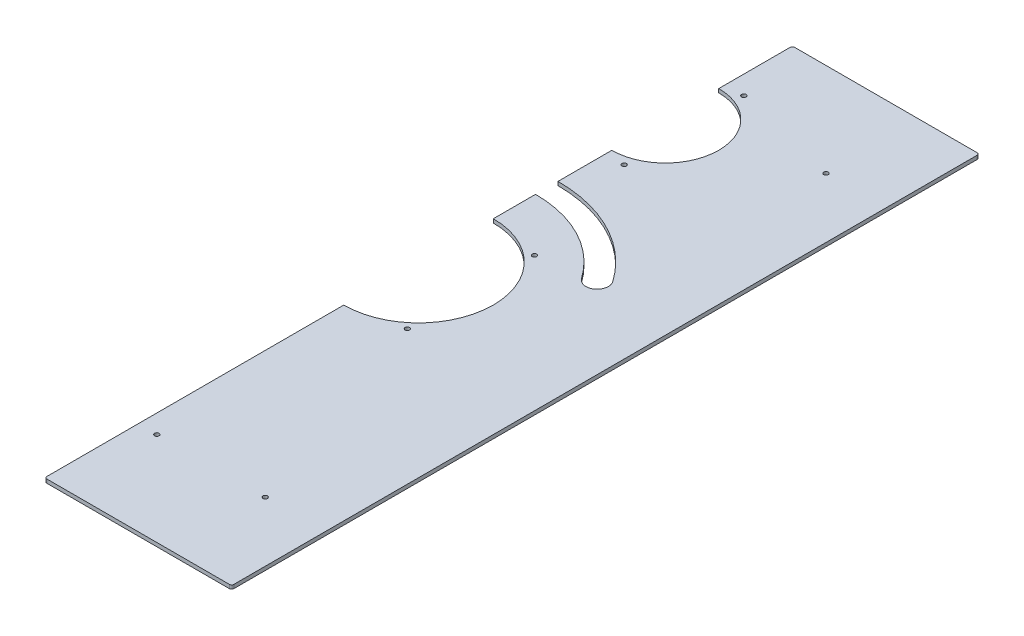
ISO-10303-21;
HEADER;
FILE_DESCRIPTION(('STEP AP214'),'2;1');
FILE_NAME('part.step','',(''),(''),'','','');
FILE_SCHEMA(('AUTOMOTIVE_DESIGN { 1 0 10303 214 1 1 1 1 }'));
ENDSEC;
DATA;
#1=APPLICATION_CONTEXT('core data for automotive mechanical design processes');
#2=APPLICATION_PROTOCOL_DEFINITION('international standard','automotive_design',2000,#1);
#3=PRODUCT_CONTEXT('',#1,'mechanical');
#4=PRODUCT('Part','Part','',(#3));
#5=PRODUCT_RELATED_PRODUCT_CATEGORY('part','',(#4));
#6=PRODUCT_DEFINITION_FORMATION('','',#4);
#7=PRODUCT_DEFINITION_CONTEXT('part definition',#1,'design');
#8=PRODUCT_DEFINITION('design','',#6,#7);
#9=PRODUCT_DEFINITION_SHAPE('','',#8);
#10=(LENGTH_UNIT() NAMED_UNIT(*) SI_UNIT(.MILLI.,.METRE.));
#11=(NAMED_UNIT(*) PLANE_ANGLE_UNIT() SI_UNIT($,.RADIAN.));
#12=(NAMED_UNIT(*) SI_UNIT($,.STERADIAN.) SOLID_ANGLE_UNIT());
#13=UNCERTAINTY_MEASURE_WITH_UNIT(LENGTH_MEASURE(1.E-05),#10,'distance_accuracy_value','');
#14=(GEOMETRIC_REPRESENTATION_CONTEXT(3) GLOBAL_UNCERTAINTY_ASSIGNED_CONTEXT((#13)) GLOBAL_UNIT_ASSIGNED_CONTEXT((#10,
#11,#12)) REPRESENTATION_CONTEXT('',''));
#15=CARTESIAN_POINT('',(0.,0.,0.));
#16=DIRECTION('',(0.,0.,1.));
#17=DIRECTION('',(1.,0.,0.));
#18=AXIS2_PLACEMENT_3D('',#15,#16,#17);
#19=CARTESIAN_POINT('',(125.,5.,500.));
#20=DIRECTION('',(1.,0.,0.));
#21=DIRECTION('',(0.,0.,1.));
#22=AXIS2_PLACEMENT_3D('',#19,#20,#21);
#23=PLANE('',#22);
#24=DIRECTION('',(0.,0.,-1.));
#25=VECTOR('',#24,1.);
#26=CARTESIAN_POINT('',(125.,0.,500.));
#27=LINE('',#26,#25);
#28=CARTESIAN_POINT('',(125.,0.,-99.9999999999999));
#29=VERTEX_POINT('',#28);
#30=CARTESIAN_POINT('',(125.,0.,-156.5));
#31=VERTEX_POINT('',#30);
#32=EDGE_CURVE('E168',#29,#31,#27,.T.);
#33=ORIENTED_EDGE('',*,*,#32,.F.);
#34=DIRECTION('',(0.,1.,0.));
#35=VECTOR('',#34,1.);
#36=CARTESIAN_POINT('',(125.,-0.00100000000000013,-99.9999999999999));
#37=LINE('',#36,#35);
#38=CARTESIAN_POINT('',(125.,5.,-99.9999999999999));
#39=VERTEX_POINT('',#38);
#40=EDGE_CURVE('E275',#29,#39,#37,.T.);
#41=ORIENTED_EDGE('',*,*,#40,.T.);
#42=DIRECTION('',(0.,0.,-1.));
#43=VECTOR('',#42,1.);
#44=CARTESIAN_POINT('',(125.,5.,500.));
#45=LINE('',#44,#43);
#46=CARTESIAN_POINT('',(125.,5.,-156.5));
#47=VERTEX_POINT('',#46);
#48=EDGE_CURVE('E170',#39,#47,#45,.T.);
#49=ORIENTED_EDGE('',*,*,#48,.T.);
#50=DIRECTION('',(0.,1.,0.));
#51=VECTOR('',#50,1.);
#52=CARTESIAN_POINT('',(125.,-0.00100000000000013,-156.5));
#53=LINE('',#52,#51);
#54=EDGE_CURVE('E156',#47,#31,#53,.F.);
#55=ORIENTED_EDGE('',*,*,#54,.T.);
#56=EDGE_LOOP('',(#33,#41,#49,#55));
#57=FACE_BOUND('',#56,.T.);
#58=ADVANCED_FACE('F37',(#57),#23,.F.);
#59=CARTESIAN_POINT('',(125.,0.,497.));
#60=VERTEX_POINT('',#59);
#61=CARTESIAN_POINT('',(125.,0.,100.));
#62=VERTEX_POINT('',#61);
#63=EDGE_CURVE('E178',#60,#62,#27,.T.);
#64=ORIENTED_EDGE('',*,*,#63,.F.);
#65=DIRECTION('',(0.,-1.,0.));
#66=VECTOR('',#65,1.);
#67=CARTESIAN_POINT('',(125.,5.,497.));
#68=LINE('',#67,#66);
#69=CARTESIAN_POINT('',(125.,5.,497.));
#70=VERTEX_POINT('',#69);
#71=EDGE_CURVE('E45',#70,#60,#68,.T.);
#72=ORIENTED_EDGE('',*,*,#71,.F.);
#73=CARTESIAN_POINT('',(125.,5.,100.));
#74=VERTEX_POINT('',#73);
#75=EDGE_CURVE('E256',#70,#74,#45,.T.);
#76=ORIENTED_EDGE('',*,*,#75,.T.);
#77=DIRECTION('',(0.,1.,0.));
#78=VECTOR('',#77,1.);
#79=CARTESIAN_POINT('',(125.,-0.00100000000000013,100.));
#80=LINE('',#79,#78);
#81=EDGE_CURVE('E239',#74,#62,#80,.F.);
#82=ORIENTED_EDGE('',*,*,#81,.T.);
#83=EDGE_LOOP('',(#64,#72,#76,#82));
#84=FACE_BOUND('',#83,.T.);
#85=ADVANCED_FACE('F237',(#84),#23,.F.);
#86=CARTESIAN_POINT('',(125.,5.,-186.5));
#87=VERTEX_POINT('',#86);
#88=CARTESIAN_POINT('',(125.,5.,-258.5));
#89=VERTEX_POINT('',#88);
#90=EDGE_CURVE('E372',#87,#89,#45,.T.);
#91=ORIENTED_EDGE('',*,*,#90,.T.);
#92=DIRECTION('',(0.,1.,0.));
#93=VECTOR('',#92,1.);
#94=CARTESIAN_POINT('',(125.,-0.00100000000000013,-258.5));
#95=LINE('',#94,#93);
#96=CARTESIAN_POINT('',(125.,0.,-258.5));
#97=VERTEX_POINT('',#96);
#98=EDGE_CURVE('E263',#89,#97,#95,.F.);
#99=ORIENTED_EDGE('',*,*,#98,.T.);
#100=CARTESIAN_POINT('',(125.,0.,-186.5));
#101=VERTEX_POINT('',#100);
#102=EDGE_CURVE('E179',#101,#97,#27,.T.);
#103=ORIENTED_EDGE('',*,*,#102,.F.);
#104=DIRECTION('',(0.,1.,0.));
#105=VECTOR('',#104,1.);
#106=CARTESIAN_POINT('',(125.,-0.00100000000000013,-186.5));
#107=LINE('',#106,#105);
#108=EDGE_CURVE('E171',#101,#87,#107,.T.);
#109=ORIENTED_EDGE('',*,*,#108,.T.);
#110=EDGE_LOOP('',(#91,#99,#103,#109));
#111=FACE_BOUND('',#110,.T.);
#112=ADVANCED_FACE('F355',(#111),#23,.F.);
#113=CARTESIAN_POINT('',(125.,5.,-401.5));
#114=VERTEX_POINT('',#113);
#115=CARTESIAN_POINT('',(125.,5.,-497.));
#116=VERTEX_POINT('',#115);
#117=EDGE_CURVE('E195',#114,#116,#45,.T.);
#118=ORIENTED_EDGE('',*,*,#117,.T.);
#119=DIRECTION('',(0.,-1.,0.));
#120=VECTOR('',#119,1.);
#121=CARTESIAN_POINT('',(125.,5.,-497.));
#122=LINE('',#121,#120);
#123=CARTESIAN_POINT('',(125.,0.,-497.));
#124=VERTEX_POINT('',#123);
#125=EDGE_CURVE('E11',#124,#116,#122,.F.);
#126=ORIENTED_EDGE('',*,*,#125,.F.);
#127=CARTESIAN_POINT('',(125.,0.,-401.5));
#128=VERTEX_POINT('',#127);
#129=EDGE_CURVE('E182',#128,#124,#27,.T.);
#130=ORIENTED_EDGE('',*,*,#129,.F.);
#131=DIRECTION('',(0.,1.,0.));
#132=VECTOR('',#131,1.);
#133=CARTESIAN_POINT('',(125.,-0.00100000000000013,-401.5));
#134=LINE('',#133,#132);
#135=EDGE_CURVE('E266',#128,#114,#134,.T.);
#136=ORIENTED_EDGE('',*,*,#135,.T.);
#137=EDGE_LOOP('',(#118,#126,#130,#136));
#138=FACE_BOUND('',#137,.T.);
#139=ADVANCED_FACE('F351',(#138),#23,.F.);
#140=CARTESIAN_POINT('',(375.,5.,-500.));
#141=DIRECTION('',(0.,0.,1.));
#142=DIRECTION('',(-1.,0.,0.));
#143=AXIS2_PLACEMENT_3D('',#140,#141,#142);
#144=PLANE('',#143);
#145=DIRECTION('',(1.,0.,0.));
#146=VECTOR('',#145,1.);
#147=CARTESIAN_POINT('',(375.,0.,-500.));
#148=LINE('',#147,#146);
#149=CARTESIAN_POINT('',(128.,0.,-500.));
#150=VERTEX_POINT('',#149);
#151=CARTESIAN_POINT('',(372.,0.,-500.));
#152=VERTEX_POINT('',#151);
#153=EDGE_CURVE('E181',#150,#152,#148,.T.);
#154=ORIENTED_EDGE('',*,*,#153,.F.);
#155=DIRECTION('',(0.,-1.,0.));
#156=VECTOR('',#155,1.);
#157=CARTESIAN_POINT('',(128.,5.,-500.));
#158=LINE('',#157,#156);
#159=CARTESIAN_POINT('',(128.,5.,-500.));
#160=VERTEX_POINT('',#159);
#161=EDGE_CURVE('E224',#160,#150,#158,.T.);
#162=ORIENTED_EDGE('',*,*,#161,.F.);
#163=DIRECTION('',(1.,0.,0.));
#164=VECTOR('',#163,1.);
#165=CARTESIAN_POINT('',(375.,5.,-500.));
#166=LINE('',#165,#164);
#167=CARTESIAN_POINT('',(372.,5.,-500.));
#168=VERTEX_POINT('',#167);
#169=EDGE_CURVE('E250',#160,#168,#166,.T.);
#170=ORIENTED_EDGE('',*,*,#169,.T.);
#171=DIRECTION('',(0.,-1.,0.));
#172=VECTOR('',#171,1.);
#173=CARTESIAN_POINT('',(372.,5.,-500.));
#174=LINE('',#173,#172);
#175=EDGE_CURVE('E227',#152,#168,#174,.F.);
#176=ORIENTED_EDGE('',*,*,#175,.F.);
#177=EDGE_LOOP('',(#154,#162,#170,#176));
#178=FACE_BOUND('',#177,.T.);
#179=ADVANCED_FACE('F359',(#178),#144,.F.);
#180=CARTESIAN_POINT('',(375.,5.,500.));
#181=DIRECTION('',(-1.,0.,0.));
#182=DIRECTION('',(0.,0.,-1.));
#183=AXIS2_PLACEMENT_3D('',#180,#181,#182);
#184=PLANE('',#183);
#185=DIRECTION('',(0.,0.,1.));
#186=VECTOR('',#185,1.);
#187=CARTESIAN_POINT('',(375.,0.,500.));
#188=LINE('',#187,#186);
#189=CARTESIAN_POINT('',(375.,0.,-497.));
#190=VERTEX_POINT('',#189);
#191=CARTESIAN_POINT('',(375.,0.,497.));
#192=VERTEX_POINT('',#191);
#193=EDGE_CURVE('E189',#190,#192,#188,.T.);
#194=ORIENTED_EDGE('',*,*,#193,.F.);
#195=DIRECTION('',(0.,-1.,0.));
#196=VECTOR('',#195,1.);
#197=CARTESIAN_POINT('',(375.,5.,-497.));
#198=LINE('',#197,#196);
#199=CARTESIAN_POINT('',(375.,5.,-497.));
#200=VERTEX_POINT('',#199);
#201=EDGE_CURVE('E210',#200,#190,#198,.T.);
#202=ORIENTED_EDGE('',*,*,#201,.F.);
#203=DIRECTION('',(0.,0.,1.));
#204=VECTOR('',#203,1.);
#205=CARTESIAN_POINT('',(375.,5.,500.));
#206=LINE('',#205,#204);
#207=CARTESIAN_POINT('',(375.,5.,497.));
#208=VERTEX_POINT('',#207);
#209=EDGE_CURVE('E248',#200,#208,#206,.T.);
#210=ORIENTED_EDGE('',*,*,#209,.T.);
#211=DIRECTION('',(0.,-1.,0.));
#212=VECTOR('',#211,1.);
#213=CARTESIAN_POINT('',(375.,5.,497.));
#214=LINE('',#213,#212);
#215=EDGE_CURVE('E213',#192,#208,#214,.F.);
#216=ORIENTED_EDGE('',*,*,#215,.F.);
#217=EDGE_LOOP('',(#194,#202,#210,#216));
#218=FACE_BOUND('',#217,.T.);
#219=ADVANCED_FACE('F365',(#218),#184,.F.);
#220=CARTESIAN_POINT('',(375.,5.,500.));
#221=DIRECTION('',(0.,0.,-1.));
#222=DIRECTION('',(1.,0.,0.));
#223=AXIS2_PLACEMENT_3D('',#220,#221,#222);
#224=PLANE('',#223);
#225=DIRECTION('',(-1.,0.,0.));
#226=VECTOR('',#225,1.);
#227=CARTESIAN_POINT('',(375.,5.,500.));
#228=LINE('',#227,#226);
#229=CARTESIAN_POINT('',(372.,5.,500.));
#230=VERTEX_POINT('',#229);
#231=CARTESIAN_POINT('',(128.,5.,500.));
#232=VERTEX_POINT('',#231);
#233=EDGE_CURVE('E185',#230,#232,#228,.T.);
#234=ORIENTED_EDGE('',*,*,#233,.T.);
#235=DIRECTION('',(0.,-1.,0.));
#236=VECTOR('',#235,1.);
#237=CARTESIAN_POINT('',(128.,5.,500.));
#238=LINE('',#237,#236);
#239=CARTESIAN_POINT('',(128.,0.,500.));
#240=VERTEX_POINT('',#239);
#241=EDGE_CURVE('E196',#240,#232,#238,.F.);
#242=ORIENTED_EDGE('',*,*,#241,.F.);
#243=DIRECTION('',(-1.,0.,0.));
#244=VECTOR('',#243,1.);
#245=CARTESIAN_POINT('',(375.,0.,500.));
#246=LINE('',#245,#244);
#247=CARTESIAN_POINT('',(372.,0.,500.));
#248=VERTEX_POINT('',#247);
#249=EDGE_CURVE('E192',#248,#240,#246,.T.);
#250=ORIENTED_EDGE('',*,*,#249,.F.);
#251=DIRECTION('',(0.,-1.,0.));
#252=VECTOR('',#251,1.);
#253=CARTESIAN_POINT('',(372.,5.,500.));
#254=LINE('',#253,#252);
#255=EDGE_CURVE('E199',#230,#248,#254,.T.);
#256=ORIENTED_EDGE('',*,*,#255,.F.);
#257=EDGE_LOOP('',(#234,#242,#250,#256));
#258=FACE_BOUND('',#257,.T.);
#259=ADVANCED_FACE('F245',(#258),#224,.F.);
#260=CARTESIAN_POINT('',(250.,5.,0.));
#261=DIRECTION('',(0.,-1.,0.));
#262=DIRECTION('',(0.,0.,-1.));
#263=AXIS2_PLACEMENT_3D('',#260,#261,#262);
#264=PLANE('',#263);
#265=CARTESIAN_POINT('',(150.,5.,-250.));
#266=DIRECTION('',(0.,-1.,0.));
#267=DIRECTION('',(0.,0.,-1.));
#268=AXIS2_PLACEMENT_3D('',#265,#266,#267);
#269=CIRCLE('',#268,3.00000000000001);
#270=CARTESIAN_POINT('',(150.,5.,-253.));
#271=VERTEX_POINT('',#270);
#272=EDGE_CURVE('E297',#271,#271,#269,.T.);
#273=ORIENTED_EDGE('',*,*,#272,.T.);
#274=EDGE_LOOP('',(#273));
#275=FACE_BOUND('',#274,.T.);
#276=CARTESIAN_POINT('',(150.,5.,-410.));
#277=DIRECTION('',(0.,-1.,0.));
#278=DIRECTION('',(0.,0.,1.));
#279=AXIS2_PLACEMENT_3D('',#276,#277,#278);
#280=CIRCLE('',#279,3.00000000000001);
#281=CARTESIAN_POINT('',(150.,5.,-407.));
#282=VERTEX_POINT('',#281);
#283=EDGE_CURVE('E304',#282,#282,#280,.T.);
#284=ORIENTED_EDGE('',*,*,#283,.T.);
#285=EDGE_LOOP('',(#284));
#286=FACE_BOUND('',#285,.T.);
#287=CARTESIAN_POINT('',(195.,5.,-85.));
#288=DIRECTION('',(0.,-1.,0.));
#289=DIRECTION('',(0.,0.,-1.));
#290=AXIS2_PLACEMENT_3D('',#287,#288,#289);
#291=CIRCLE('',#290,3.);
#292=CARTESIAN_POINT('',(195.,5.,-88.));
#293=VERTEX_POINT('',#292);
#294=EDGE_CURVE('E286',#293,#293,#291,.T.);
#295=ORIENTED_EDGE('',*,*,#294,.T.);
#296=EDGE_LOOP('',(#295));
#297=FACE_BOUND('',#296,.T.);
#298=CARTESIAN_POINT('',(295.,5.,375.));
#299=DIRECTION('',(0.,-1.,0.));
#300=DIRECTION('',(0.,0.,1.));
#301=AXIS2_PLACEMENT_3D('',#298,#299,#300);
#302=CIRCLE('',#301,3.);
#303=CARTESIAN_POINT('',(295.,5.,378.));
#304=VERTEX_POINT('',#303);
#305=EDGE_CURVE('E269',#304,#304,#302,.T.);
#306=ORIENTED_EDGE('',*,*,#305,.T.);
#307=EDGE_LOOP('',(#306));
#308=FACE_BOUND('',#307,.T.);
#309=CARTESIAN_POINT('',(295.,5.,-375.));
#310=DIRECTION('',(0.,-1.,0.));
#311=DIRECTION('',(0.,0.,-1.));
#312=AXIS2_PLACEMENT_3D('',#309,#310,#311);
#313=CIRCLE('',#312,3.);
#314=CARTESIAN_POINT('',(295.,5.,-378.));
#315=VERTEX_POINT('',#314);
#316=EDGE_CURVE('E277',#315,#315,#313,.T.);
#317=ORIENTED_EDGE('',*,*,#316,.T.);
#318=EDGE_LOOP('',(#317));
#319=FACE_BOUND('',#318,.T.);
#320=CARTESIAN_POINT('',(195.,5.,85.));
#321=DIRECTION('',(0.,-1.,0.));
#322=DIRECTION('',(0.,0.,1.));
#323=AXIS2_PLACEMENT_3D('',#320,#321,#322);
#324=CIRCLE('',#323,3.);
#325=CARTESIAN_POINT('',(195.,5.,88.));
#326=VERTEX_POINT('',#325);
#327=EDGE_CURVE('E285',#326,#326,#324,.T.);
#328=ORIENTED_EDGE('',*,*,#327,.T.);
#329=EDGE_LOOP('',(#328));
#330=FACE_BOUND('',#329,.T.);
#331=CARTESIAN_POINT('',(150.,5.,375.));
#332=DIRECTION('',(0.,-1.,0.));
#333=DIRECTION('',(0.,0.,1.));
#334=AXIS2_PLACEMENT_3D('',#331,#332,#333);
#335=CIRCLE('',#334,3.00000000000001);
#336=CARTESIAN_POINT('',(150.,5.,378.));
#337=VERTEX_POINT('',#336);
#338=EDGE_CURVE('E298',#337,#337,#335,.T.);
#339=ORIENTED_EDGE('',*,*,#338,.T.);
#340=EDGE_LOOP('',(#339));
#341=FACE_BOUND('',#340,.T.);
#342=ORIENTED_EDGE('',*,*,#48,.F.);
#343=CARTESIAN_POINT('',(125.,5.,1.11022302462516E-13));
#344=DIRECTION('',(0.,-1.,0.));
#345=DIRECTION('',(0.,0.,1.));
#346=AXIS2_PLACEMENT_3D('',#343,#344,#345);
#347=CIRCLE('',#346,100.);
#348=EDGE_CURVE('E272',#39,#74,#347,.T.);
#349=ORIENTED_EDGE('',*,*,#348,.T.);
#350=ORIENTED_EDGE('',*,*,#75,.F.);
#351=CARTESIAN_POINT('',(128.,5.,497.));
#352=DIRECTION('',(0.,1.,0.));
#353=DIRECTION('',(0.,0.,-1.));
#354=AXIS2_PLACEMENT_3D('',#351,#352,#353);
#355=CIRCLE('',#354,3.);
#356=EDGE_CURVE('E216',#232,#70,#355,.F.);
#357=ORIENTED_EDGE('',*,*,#356,.F.);
#358=ORIENTED_EDGE('',*,*,#233,.F.);
#359=CARTESIAN_POINT('',(372.,5.,497.));
#360=DIRECTION('',(0.,1.,0.));
#361=DIRECTION('',(0.,0.,-1.));
#362=AXIS2_PLACEMENT_3D('',#359,#360,#361);
#363=CIRCLE('',#362,3.);
#364=EDGE_CURVE('E222',#208,#230,#363,.F.);
#365=ORIENTED_EDGE('',*,*,#364,.F.);
#366=ORIENTED_EDGE('',*,*,#209,.F.);
#367=CARTESIAN_POINT('',(372.,5.,-497.));
#368=DIRECTION('',(0.,1.,0.));
#369=DIRECTION('',(0.,0.,-1.));
#370=AXIS2_PLACEMENT_3D('',#367,#368,#369);
#371=CIRCLE('',#370,3.);
#372=EDGE_CURVE('E220',#168,#200,#371,.F.);
#373=ORIENTED_EDGE('',*,*,#372,.F.);
#374=ORIENTED_EDGE('',*,*,#169,.F.);
#375=CARTESIAN_POINT('',(128.,5.,-497.));
#376=DIRECTION('',(0.,1.,0.));
#377=DIRECTION('',(0.,0.,-1.));
#378=AXIS2_PLACEMENT_3D('',#375,#376,#377);
#379=CIRCLE('',#378,3.);
#380=EDGE_CURVE('E218',#116,#160,#379,.F.);
#381=ORIENTED_EDGE('',*,*,#380,.F.);
#382=ORIENTED_EDGE('',*,*,#117,.F.);
#383=CARTESIAN_POINT('',(125.,5.,-330.));
#384=DIRECTION('',(0.,-1.,0.));
#385=DIRECTION('',(0.,0.,1.));
#386=AXIS2_PLACEMENT_3D('',#383,#384,#385);
#387=CIRCLE('',#386,71.5);
#388=EDGE_CURVE('E261',#114,#89,#387,.T.);
#389=ORIENTED_EDGE('',*,*,#388,.T.);
#390=ORIENTED_EDGE('',*,*,#90,.F.);
#391=CARTESIAN_POINT('',(125.,5.,0.));
#392=DIRECTION('',(0.,-1.,0.));
#393=DIRECTION('',(0.,0.,1.));
#394=AXIS2_PLACEMENT_3D('',#391,#392,#393);
#395=CIRCLE('',#394,186.5);
#396=CARTESIAN_POINT('',(277.771856259897,5.,-106.97200537947));
#397=VERTEX_POINT('',#396);
#398=EDGE_CURVE('E162',#87,#397,#395,.T.);
#399=ORIENTED_EDGE('',*,*,#398,.T.);
#400=CARTESIAN_POINT('',(265.484575595562,5.,-98.3683588342042));
#401=DIRECTION('',(0.,-1.,0.));
#402=DIRECTION('',(0.,0.,1.));
#403=AXIS2_PLACEMENT_3D('',#400,#401,#402);
#404=CIRCLE('',#403,15.);
#405=CARTESIAN_POINT('',(253.197294931227,5.,-89.7647122889385));
#406=VERTEX_POINT('',#405);
#407=EDGE_CURVE('E318',#397,#406,#404,.T.);
#408=ORIENTED_EDGE('',*,*,#407,.T.);
#409=CARTESIAN_POINT('',(125.,5.,0.));
#410=DIRECTION('',(0.,1.,0.));
#411=DIRECTION('',(0.,0.,1.));
#412=AXIS2_PLACEMENT_3D('',#409,#410,#411);
#413=CIRCLE('',#412,156.5);
#414=EDGE_CURVE('E315',#406,#47,#413,.T.);
#415=ORIENTED_EDGE('',*,*,#414,.T.);
#416=EDGE_LOOP('',(#342,#349,#350,#357,#358,#365,#366,#373,#374,#381,#382,#389,#390,#399,#408,#415));
#417=FACE_BOUND('',#416,.T.);
#418=ADVANCED_FACE('F332',(#275,#286,#297,#308,#319,#330,#341,#417),#264,.F.);
#419=CARTESIAN_POINT('',(250.,0.,0.));
#420=DIRECTION('',(0.,-1.,0.));
#421=DIRECTION('',(0.,0.,-1.));
#422=AXIS2_PLACEMENT_3D('',#419,#420,#421);
#423=PLANE('',#422);
#424=CARTESIAN_POINT('',(150.,0.,-250.));
#425=DIRECTION('',(0.,1.,0.));
#426=DIRECTION('',(0.,0.,-1.));
#427=AXIS2_PLACEMENT_3D('',#424,#425,#426);
#428=CIRCLE('',#427,3.00000000000001);
#429=CARTESIAN_POINT('',(150.,0.,-253.));
#430=VERTEX_POINT('',#429);
#431=EDGE_CURVE('E294',#430,#430,#428,.F.);
#432=ORIENTED_EDGE('',*,*,#431,.F.);
#433=EDGE_LOOP('',(#432));
#434=FACE_BOUND('',#433,.T.);
#435=CARTESIAN_POINT('',(150.,0.,-410.));
#436=DIRECTION('',(0.,1.,0.));
#437=DIRECTION('',(0.,0.,-1.));
#438=AXIS2_PLACEMENT_3D('',#435,#436,#437);
#439=CIRCLE('',#438,3.00000000000001);
#440=CARTESIAN_POINT('',(150.,0.,-413.));
#441=VERTEX_POINT('',#440);
#442=EDGE_CURVE('E301',#441,#441,#439,.F.);
#443=ORIENTED_EDGE('',*,*,#442,.F.);
#444=EDGE_LOOP('',(#443));
#445=FACE_BOUND('',#444,.T.);
#446=CARTESIAN_POINT('',(195.,0.,-85.));
#447=DIRECTION('',(0.,1.,0.));
#448=DIRECTION('',(0.,0.,-1.));
#449=AXIS2_PLACEMENT_3D('',#446,#447,#448);
#450=CIRCLE('',#449,3.);
#451=CARTESIAN_POINT('',(195.,0.,-88.));
#452=VERTEX_POINT('',#451);
#453=EDGE_CURVE('E307',#452,#452,#450,.F.);
#454=ORIENTED_EDGE('',*,*,#453,.F.);
#455=EDGE_LOOP('',(#454));
#456=FACE_BOUND('',#455,.T.);
#457=CARTESIAN_POINT('',(125.,0.,0.));
#458=DIRECTION('',(0.,1.,0.));
#459=DIRECTION('',(0.,0.,-1.));
#460=AXIS2_PLACEMENT_3D('',#457,#458,#459);
#461=CIRCLE('',#460,156.5);
#462=CARTESIAN_POINT('',(253.197294931227,0.,-89.7647122889385));
#463=VERTEX_POINT('',#462);
#464=EDGE_CURVE('E152',#463,#31,#461,.T.);
#465=ORIENTED_EDGE('',*,*,#464,.F.);
#466=CARTESIAN_POINT('',(265.484575595562,0.,-98.3683588342042));
#467=DIRECTION('',(0.,1.,0.));
#468=DIRECTION('',(0.,0.,-1.));
#469=AXIS2_PLACEMENT_3D('',#466,#467,#468);
#470=CIRCLE('',#469,15.);
#471=CARTESIAN_POINT('',(277.771856259897,0.,-106.97200537947));
#472=VERTEX_POINT('',#471);
#473=EDGE_CURVE('E163',#472,#463,#470,.F.);
#474=ORIENTED_EDGE('',*,*,#473,.F.);
#475=CARTESIAN_POINT('',(125.,0.,0.));
#476=DIRECTION('',(0.,1.,0.));
#477=DIRECTION('',(0.,0.,-1.));
#478=AXIS2_PLACEMENT_3D('',#475,#476,#477);
#479=CIRCLE('',#478,186.5);
#480=EDGE_CURVE('E310',#101,#472,#479,.F.);
#481=ORIENTED_EDGE('',*,*,#480,.F.);
#482=ORIENTED_EDGE('',*,*,#102,.T.);
#483=CARTESIAN_POINT('',(125.,0.,-330.));
#484=DIRECTION('',(0.,1.,0.));
#485=DIRECTION('',(0.,0.,-1.));
#486=AXIS2_PLACEMENT_3D('',#483,#484,#485);
#487=CIRCLE('',#486,71.5);
#488=EDGE_CURVE('E60',#128,#97,#487,.F.);
#489=ORIENTED_EDGE('',*,*,#488,.F.);
#490=ORIENTED_EDGE('',*,*,#129,.T.);
#491=CARTESIAN_POINT('',(128.,0.,-497.));
#492=DIRECTION('',(0.,1.,0.));
#493=DIRECTION('',(0.,0.,-1.));
#494=AXIS2_PLACEMENT_3D('',#491,#492,#493);
#495=CIRCLE('',#494,3.);
#496=EDGE_CURVE('E204',#150,#124,#495,.T.);
#497=ORIENTED_EDGE('',*,*,#496,.F.);
#498=ORIENTED_EDGE('',*,*,#153,.T.);
#499=CARTESIAN_POINT('',(372.,0.,-497.));
#500=DIRECTION('',(0.,1.,0.));
#501=DIRECTION('',(0.,0.,-1.));
#502=AXIS2_PLACEMENT_3D('',#499,#500,#501);
#503=CIRCLE('',#502,3.);
#504=EDGE_CURVE('E206',#190,#152,#503,.T.);
#505=ORIENTED_EDGE('',*,*,#504,.F.);
#506=ORIENTED_EDGE('',*,*,#193,.T.);
#507=CARTESIAN_POINT('',(372.,0.,497.));
#508=DIRECTION('',(0.,1.,0.));
#509=DIRECTION('',(0.,0.,-1.));
#510=AXIS2_PLACEMENT_3D('',#507,#508,#509);
#511=CIRCLE('',#510,3.);
#512=EDGE_CURVE('E208',#248,#192,#511,.T.);
#513=ORIENTED_EDGE('',*,*,#512,.F.);
#514=ORIENTED_EDGE('',*,*,#249,.T.);
#515=CARTESIAN_POINT('',(128.,0.,497.));
#516=DIRECTION('',(0.,1.,0.));
#517=DIRECTION('',(0.,0.,-1.));
#518=AXIS2_PLACEMENT_3D('',#515,#516,#517);
#519=CIRCLE('',#518,3.);
#520=EDGE_CURVE('E202',#60,#240,#519,.T.);
#521=ORIENTED_EDGE('',*,*,#520,.F.);
#522=ORIENTED_EDGE('',*,*,#63,.T.);
#523=CARTESIAN_POINT('',(125.,0.,1.11022302462516E-13));
#524=DIRECTION('',(0.,1.,0.));
#525=DIRECTION('',(0.,0.,-1.));
#526=AXIS2_PLACEMENT_3D('',#523,#524,#525);
#527=CIRCLE('',#526,100.);
#528=EDGE_CURVE('E176',#29,#62,#527,.F.);
#529=ORIENTED_EDGE('',*,*,#528,.F.);
#530=ORIENTED_EDGE('',*,*,#32,.T.);
#531=EDGE_LOOP('',(#465,#474,#481,#482,#489,#490,#497,#498,#505,#506,#513,#514,#521,#522,#529,#530));
#532=FACE_BOUND('',#531,.T.);
#533=CARTESIAN_POINT('',(295.,0.,375.));
#534=DIRECTION('',(0.,1.,0.));
#535=DIRECTION('',(0.,0.,-1.));
#536=AXIS2_PLACEMENT_3D('',#533,#534,#535);
#537=CIRCLE('',#536,3.);
#538=CARTESIAN_POINT('',(295.,0.,372.));
#539=VERTEX_POINT('',#538);
#540=EDGE_CURVE('E271',#539,#539,#537,.F.);
#541=ORIENTED_EDGE('',*,*,#540,.F.);
#542=EDGE_LOOP('',(#541));
#543=FACE_BOUND('',#542,.T.);
#544=CARTESIAN_POINT('',(295.,0.,-375.));
#545=DIRECTION('',(0.,1.,0.));
#546=DIRECTION('',(0.,0.,-1.));
#547=AXIS2_PLACEMENT_3D('',#544,#545,#546);
#548=CIRCLE('',#547,3.);
#549=CARTESIAN_POINT('',(295.,0.,-378.));
#550=VERTEX_POINT('',#549);
#551=EDGE_CURVE('E289',#550,#550,#548,.F.);
#552=ORIENTED_EDGE('',*,*,#551,.F.);
#553=EDGE_LOOP('',(#552));
#554=FACE_BOUND('',#553,.T.);
#555=CARTESIAN_POINT('',(195.,0.,85.));
#556=DIRECTION('',(0.,1.,0.));
#557=DIRECTION('',(0.,0.,-1.));
#558=AXIS2_PLACEMENT_3D('',#555,#556,#557);
#559=CIRCLE('',#558,3.);
#560=CARTESIAN_POINT('',(195.,0.,82.));
#561=VERTEX_POINT('',#560);
#562=EDGE_CURVE('E282',#561,#561,#559,.F.);
#563=ORIENTED_EDGE('',*,*,#562,.F.);
#564=EDGE_LOOP('',(#563));
#565=FACE_BOUND('',#564,.T.);
#566=CARTESIAN_POINT('',(150.,0.,375.));
#567=DIRECTION('',(0.,1.,0.));
#568=DIRECTION('',(0.,0.,-1.));
#569=AXIS2_PLACEMENT_3D('',#566,#567,#568);
#570=CIRCLE('',#569,3.00000000000001);
#571=CARTESIAN_POINT('',(150.,0.,372.));
#572=VERTEX_POINT('',#571);
#573=EDGE_CURVE('E326',#572,#572,#570,.F.);
#574=ORIENTED_EDGE('',*,*,#573,.F.);
#575=EDGE_LOOP('',(#574));
#576=FACE_BOUND('',#575,.T.);
#577=ADVANCED_FACE('F173',(#434,#445,#456,#532,#543,#554,#565,#576),#423,.T.);
#578=CARTESIAN_POINT('',(372.,5.,497.));
#579=DIRECTION('',(0.,-1.,0.));
#580=DIRECTION('',(0.,0.,-1.));
#581=AXIS2_PLACEMENT_3D('',#578,#579,#580);
#582=CYLINDRICAL_SURFACE('',#581,3.);
#583=ORIENTED_EDGE('',*,*,#364,.T.);
#584=ORIENTED_EDGE('',*,*,#255,.T.);
#585=ORIENTED_EDGE('',*,*,#512,.T.);
#586=ORIENTED_EDGE('',*,*,#215,.T.);
#587=EDGE_LOOP('',(#583,#584,#585,#586));
#588=FACE_BOUND('',#587,.T.);
#589=ADVANCED_FACE('F400',(#588),#582,.T.);
#590=CARTESIAN_POINT('',(372.,5.,-497.));
#591=DIRECTION('',(0.,-1.,0.));
#592=DIRECTION('',(0.,0.,-1.));
#593=AXIS2_PLACEMENT_3D('',#590,#591,#592);
#594=CYLINDRICAL_SURFACE('',#593,3.);
#595=ORIENTED_EDGE('',*,*,#372,.T.);
#596=ORIENTED_EDGE('',*,*,#201,.T.);
#597=ORIENTED_EDGE('',*,*,#504,.T.);
#598=ORIENTED_EDGE('',*,*,#175,.T.);
#599=EDGE_LOOP('',(#595,#596,#597,#598));
#600=FACE_BOUND('',#599,.T.);
#601=ADVANCED_FACE('F411',(#600),#594,.T.);
#602=CARTESIAN_POINT('',(128.,5.,-497.));
#603=DIRECTION('',(0.,-1.,0.));
#604=DIRECTION('',(0.,0.,-1.));
#605=AXIS2_PLACEMENT_3D('',#602,#603,#604);
#606=CYLINDRICAL_SURFACE('',#605,3.);
#607=ORIENTED_EDGE('',*,*,#380,.T.);
#608=ORIENTED_EDGE('',*,*,#161,.T.);
#609=ORIENTED_EDGE('',*,*,#496,.T.);
#610=ORIENTED_EDGE('',*,*,#125,.T.);
#611=EDGE_LOOP('',(#607,#608,#609,#610));
#612=FACE_BOUND('',#611,.T.);
#613=ADVANCED_FACE('F418',(#612),#606,.T.);
#614=CARTESIAN_POINT('',(128.,5.,497.));
#615=DIRECTION('',(0.,-1.,0.));
#616=DIRECTION('',(0.,0.,-1.));
#617=AXIS2_PLACEMENT_3D('',#614,#615,#616);
#618=CYLINDRICAL_SURFACE('',#617,3.);
#619=ORIENTED_EDGE('',*,*,#356,.T.);
#620=ORIENTED_EDGE('',*,*,#71,.T.);
#621=ORIENTED_EDGE('',*,*,#520,.T.);
#622=ORIENTED_EDGE('',*,*,#241,.T.);
#623=EDGE_LOOP('',(#619,#620,#621,#622));
#624=FACE_BOUND('',#623,.T.);
#625=ADVANCED_FACE('F39',(#624),#618,.T.);
#626=CARTESIAN_POINT('',(125.,-0.00100000000000013,-330.));
#627=DIRECTION('',(0.,1.,0.));
#628=DIRECTION('',(0.,0.,1.));
#629=AXIS2_PLACEMENT_3D('',#626,#627,#628);
#630=CYLINDRICAL_SURFACE('',#629,71.5);
#631=ORIENTED_EDGE('',*,*,#98,.F.);
#632=ORIENTED_EDGE('',*,*,#388,.F.);
#633=ORIENTED_EDGE('',*,*,#135,.F.);
#634=ORIENTED_EDGE('',*,*,#488,.T.);
#635=EDGE_LOOP('',(#631,#632,#633,#634));
#636=FACE_BOUND('',#635,.T.);
#637=ADVANCED_FACE('F337',(#636),#630,.F.);
#638=CARTESIAN_POINT('',(150.,-0.00100000000000013,375.));
#639=DIRECTION('',(0.,1.,0.));
#640=DIRECTION('',(0.,0.,1.));
#641=AXIS2_PLACEMENT_3D('',#638,#639,#640);
#642=CYLINDRICAL_SURFACE('',#641,3.00000000000001);
#643=ORIENTED_EDGE('',*,*,#573,.T.);
#644=EDGE_LOOP('',(#643));
#645=FACE_BOUND('',#644,.T.);
#646=ORIENTED_EDGE('',*,*,#338,.F.);
#647=EDGE_LOOP('',(#646));
#648=FACE_BOUND('',#647,.T.);
#649=ADVANCED_FACE('F334',(#645,#648),#642,.F.);
#650=CARTESIAN_POINT('',(195.,-0.00100000000000013,85.));
#651=DIRECTION('',(0.,1.,0.));
#652=DIRECTION('',(0.,0.,1.));
#653=AXIS2_PLACEMENT_3D('',#650,#651,#652);
#654=CYLINDRICAL_SURFACE('',#653,3.);
#655=ORIENTED_EDGE('',*,*,#562,.T.);
#656=EDGE_LOOP('',(#655));
#657=FACE_BOUND('',#656,.T.);
#658=ORIENTED_EDGE('',*,*,#327,.F.);
#659=EDGE_LOOP('',(#658));
#660=FACE_BOUND('',#659,.T.);
#661=ADVANCED_FACE('F336',(#657,#660),#654,.F.);
#662=CARTESIAN_POINT('',(295.,-0.00100000000000013,-375.));
#663=DIRECTION('',(0.,1.,0.));
#664=DIRECTION('',(0.,0.,1.));
#665=AXIS2_PLACEMENT_3D('',#662,#663,#664);
#666=CYLINDRICAL_SURFACE('',#665,3.);
#667=ORIENTED_EDGE('',*,*,#551,.T.);
#668=EDGE_LOOP('',(#667));
#669=FACE_BOUND('',#668,.T.);
#670=ORIENTED_EDGE('',*,*,#316,.F.);
#671=EDGE_LOOP('',(#670));
#672=FACE_BOUND('',#671,.T.);
#673=ADVANCED_FACE('F344',(#669,#672),#666,.F.);
#674=CARTESIAN_POINT('',(125.,-0.00100000000000013,1.11022302462516E-13));
#675=DIRECTION('',(0.,1.,0.));
#676=DIRECTION('',(0.,0.,1.));
#677=AXIS2_PLACEMENT_3D('',#674,#675,#676);
#678=CYLINDRICAL_SURFACE('',#677,100.);
#679=ORIENTED_EDGE('',*,*,#81,.F.);
#680=ORIENTED_EDGE('',*,*,#348,.F.);
#681=ORIENTED_EDGE('',*,*,#40,.F.);
#682=ORIENTED_EDGE('',*,*,#528,.T.);
#683=EDGE_LOOP('',(#679,#680,#681,#682));
#684=FACE_BOUND('',#683,.T.);
#685=ADVANCED_FACE('F382',(#684),#678,.F.);
#686=CARTESIAN_POINT('',(295.,-0.00100000000000013,375.));
#687=DIRECTION('',(0.,1.,0.));
#688=DIRECTION('',(0.,0.,1.));
#689=AXIS2_PLACEMENT_3D('',#686,#687,#688);
#690=CYLINDRICAL_SURFACE('',#689,3.);
#691=ORIENTED_EDGE('',*,*,#540,.T.);
#692=EDGE_LOOP('',(#691));
#693=FACE_BOUND('',#692,.T.);
#694=ORIENTED_EDGE('',*,*,#305,.F.);
#695=EDGE_LOOP('',(#694));
#696=FACE_BOUND('',#695,.T.);
#697=ADVANCED_FACE('F384',(#693,#696),#690,.F.);
#698=CARTESIAN_POINT('',(125.,-0.00100000000000013,0.));
#699=DIRECTION('',(0.,1.,0.));
#700=DIRECTION('',(0.,0.,1.));
#701=AXIS2_PLACEMENT_3D('',#698,#699,#700);
#702=CYLINDRICAL_SURFACE('',#701,156.5);
#703=DIRECTION('',(0.,1.,0.));
#704=VECTOR('',#703,1.);
#705=CARTESIAN_POINT('',(253.197294931227,-0.00100000000000013,-89.7647122889385));
#706=LINE('',#705,#704);
#707=EDGE_CURVE('E158',#463,#406,#706,.T.);
#708=ORIENTED_EDGE('',*,*,#707,.F.);
#709=ORIENTED_EDGE('',*,*,#464,.T.);
#710=ORIENTED_EDGE('',*,*,#54,.F.);
#711=ORIENTED_EDGE('',*,*,#414,.F.);
#712=EDGE_LOOP('',(#708,#709,#710,#711));
#713=FACE_BOUND('',#712,.T.);
#714=ADVANCED_FACE('F154',(#713),#702,.T.);
#715=CARTESIAN_POINT('',(265.484575595562,-0.00100000000000013,-98.3683588342042));
#716=DIRECTION('',(0.,1.,0.));
#717=DIRECTION('',(0.,0.,1.));
#718=AXIS2_PLACEMENT_3D('',#715,#716,#717);
#719=CYLINDRICAL_SURFACE('',#718,15.);
#720=DIRECTION('',(0.,1.,0.));
#721=VECTOR('',#720,1.);
#722=CARTESIAN_POINT('',(277.771856259897,-0.00100000000000013,-106.97200537947));
#723=LINE('',#722,#721);
#724=EDGE_CURVE('E52',#472,#397,#723,.T.);
#725=ORIENTED_EDGE('',*,*,#724,.F.);
#726=ORIENTED_EDGE('',*,*,#473,.T.);
#727=ORIENTED_EDGE('',*,*,#707,.T.);
#728=ORIENTED_EDGE('',*,*,#407,.F.);
#729=EDGE_LOOP('',(#725,#726,#727,#728));
#730=FACE_BOUND('',#729,.T.);
#731=ADVANCED_FACE('F380',(#730),#719,.F.);
#732=CARTESIAN_POINT('',(125.,-0.00100000000000013,0.));
#733=DIRECTION('',(0.,1.,0.));
#734=DIRECTION('',(0.,0.,1.));
#735=AXIS2_PLACEMENT_3D('',#732,#733,#734);
#736=CYLINDRICAL_SURFACE('',#735,186.5);
#737=ORIENTED_EDGE('',*,*,#108,.F.);
#738=ORIENTED_EDGE('',*,*,#480,.T.);
#739=ORIENTED_EDGE('',*,*,#724,.T.);
#740=ORIENTED_EDGE('',*,*,#398,.F.);
#741=EDGE_LOOP('',(#737,#738,#739,#740));
#742=FACE_BOUND('',#741,.T.);
#743=ADVANCED_FACE('F379',(#742),#736,.F.);
#744=CARTESIAN_POINT('',(195.,-0.00100000000000013,-85.));
#745=DIRECTION('',(0.,1.,0.));
#746=DIRECTION('',(0.,0.,1.));
#747=AXIS2_PLACEMENT_3D('',#744,#745,#746);
#748=CYLINDRICAL_SURFACE('',#747,3.);
#749=ORIENTED_EDGE('',*,*,#453,.T.);
#750=EDGE_LOOP('',(#749));
#751=FACE_BOUND('',#750,.T.);
#752=ORIENTED_EDGE('',*,*,#294,.F.);
#753=EDGE_LOOP('',(#752));
#754=FACE_BOUND('',#753,.T.);
#755=ADVANCED_FACE('F482',(#751,#754),#748,.F.);
#756=CARTESIAN_POINT('',(150.,-0.00100000000000013,-410.));
#757=DIRECTION('',(0.,1.,0.));
#758=DIRECTION('',(0.,0.,1.));
#759=AXIS2_PLACEMENT_3D('',#756,#757,#758);
#760=CYLINDRICAL_SURFACE('',#759,3.00000000000001);
#761=ORIENTED_EDGE('',*,*,#442,.T.);
#762=EDGE_LOOP('',(#761));
#763=FACE_BOUND('',#762,.T.);
#764=ORIENTED_EDGE('',*,*,#283,.F.);
#765=EDGE_LOOP('',(#764));
#766=FACE_BOUND('',#765,.T.);
#767=ADVANCED_FACE('F491',(#763,#766),#760,.F.);
#768=CARTESIAN_POINT('',(150.,-0.00100000000000013,-250.));
#769=DIRECTION('',(0.,1.,0.));
#770=DIRECTION('',(0.,0.,1.));
#771=AXIS2_PLACEMENT_3D('',#768,#769,#770);
#772=CYLINDRICAL_SURFACE('',#771,3.00000000000001);
#773=ORIENTED_EDGE('',*,*,#431,.T.);
#774=EDGE_LOOP('',(#773));
#775=FACE_BOUND('',#774,.T.);
#776=ORIENTED_EDGE('',*,*,#272,.F.);
#777=EDGE_LOOP('',(#776));
#778=FACE_BOUND('',#777,.T.);
#779=ADVANCED_FACE('F501',(#775,#778),#772,.F.);
#780=CLOSED_SHELL('',(#58,#85,#112,#139,#179,#219,#259,#418,#577,#589,#601,#613,#625,#637,#649,
#661,#673,#685,#697,#714,#731,#743,#755,#767,#779));
#781=MANIFOLD_SOLID_BREP('B2',#780);
#782=ADVANCED_BREP_SHAPE_REPRESENTATION('',(#18,#781),#14);
#783=SHAPE_DEFINITION_REPRESENTATION(#9,#782);
ENDSEC;
END-ISO-10303-21;
